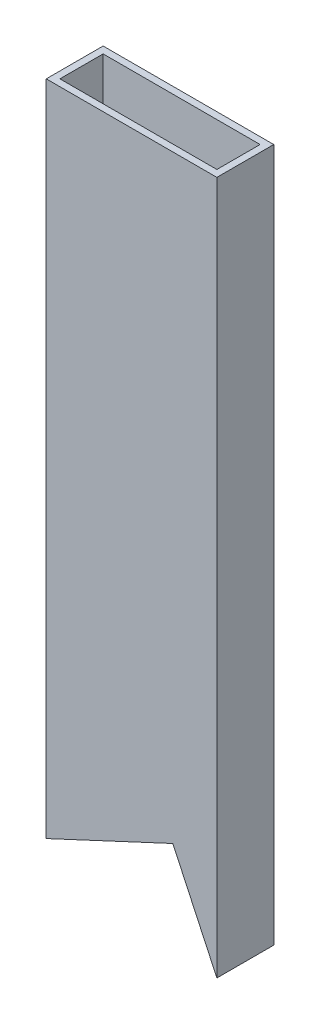
ISO-10303-21;
HEADER;
FILE_DESCRIPTION(('STEP AP214'),'2;1');
FILE_NAME('part.step','',(''),(''),'','','');
FILE_SCHEMA(('AUTOMOTIVE_DESIGN { 1 0 10303 214 1 1 1 1 }'));
ENDSEC;
DATA;
#1=APPLICATION_CONTEXT('core data for automotive mechanical design processes');
#2=APPLICATION_PROTOCOL_DEFINITION('international standard','automotive_design',2000,#1);
#3=PRODUCT_CONTEXT('',#1,'mechanical');
#4=PRODUCT('Part','Part','',(#3));
#5=PRODUCT_RELATED_PRODUCT_CATEGORY('part','',(#4));
#6=PRODUCT_DEFINITION_FORMATION('','',#4);
#7=PRODUCT_DEFINITION_CONTEXT('part definition',#1,'design');
#8=PRODUCT_DEFINITION('design','',#6,#7);
#9=PRODUCT_DEFINITION_SHAPE('','',#8);
#10=(LENGTH_UNIT() NAMED_UNIT(*) SI_UNIT(.MILLI.,.METRE.));
#11=(NAMED_UNIT(*) PLANE_ANGLE_UNIT() SI_UNIT($,.RADIAN.));
#12=(NAMED_UNIT(*) SI_UNIT($,.STERADIAN.) SOLID_ANGLE_UNIT());
#13=UNCERTAINTY_MEASURE_WITH_UNIT(LENGTH_MEASURE(1.E-05),#10,'distance_accuracy_value','');
#14=(GEOMETRIC_REPRESENTATION_CONTEXT(3) GLOBAL_UNCERTAINTY_ASSIGNED_CONTEXT((#13)) GLOBAL_UNIT_ASSIGNED_CONTEXT((#10,
#11,#12)) REPRESENTATION_CONTEXT('',''));
#15=CARTESIAN_POINT('',(0.,0.,0.));
#16=DIRECTION('',(0.,0.,1.));
#17=DIRECTION('',(1.,0.,0.));
#18=AXIS2_PLACEMENT_3D('',#15,#16,#17);
#19=CARTESIAN_POINT('',(-38.1,280.,-12.7));
#20=DIRECTION('',(1.,0.,0.));
#21=DIRECTION('',(0.,0.,-1.));
#22=AXIS2_PLACEMENT_3D('',#19,#20,#21);
#23=PLANE('',#22);
#24=DIRECTION('',(0.,0.,-1.));
#25=VECTOR('',#24,1.);
#26=CARTESIAN_POINT('',(-38.1,24.2723769367656,-12.7));
#27=LINE('',#26,#25);
#28=CARTESIAN_POINT('',(-38.1,24.2723769367657,12.7));
#29=VERTEX_POINT('',#28);
#30=CARTESIAN_POINT('',(-38.1,24.2723769367657,-12.7));
#31=VERTEX_POINT('',#30);
#32=EDGE_CURVE('E147',#29,#31,#27,.T.);
#33=ORIENTED_EDGE('',*,*,#32,.F.);
#34=DIRECTION('',(0.,-1.,0.));
#35=VECTOR('',#34,1.);
#36=CARTESIAN_POINT('',(-38.1,280.,12.7));
#37=LINE('',#36,#35);
#38=CARTESIAN_POINT('',(-38.1,318.1,12.7));
#39=VERTEX_POINT('',#38);
#40=EDGE_CURVE('E132',#39,#29,#37,.T.);
#41=ORIENTED_EDGE('',*,*,#40,.F.);
#42=DIRECTION('',(0.,0.,1.));
#43=VECTOR('',#42,1.);
#44=CARTESIAN_POINT('',(-38.1,318.1,-12.7));
#45=LINE('',#44,#43);
#46=CARTESIAN_POINT('',(-38.1,318.1,-12.7));
#47=VERTEX_POINT('',#46);
#48=EDGE_CURVE('E164',#47,#39,#45,.T.);
#49=ORIENTED_EDGE('',*,*,#48,.F.);
#50=DIRECTION('',(0.,-1.,0.));
#51=VECTOR('',#50,1.);
#52=CARTESIAN_POINT('',(-38.1,280.,-12.7));
#53=LINE('',#52,#51);
#54=EDGE_CURVE('E185',#47,#31,#53,.T.);
#55=ORIENTED_EDGE('',*,*,#54,.T.);
#56=EDGE_LOOP('',(#33,#41,#49,#55));
#57=FACE_BOUND('',#56,.T.);
#58=ADVANCED_FACE('F36',(#57),#23,.F.);
#59=CARTESIAN_POINT('',(-38.1,280.,12.7));
#60=DIRECTION('',(0.,0.,-1.));
#61=DIRECTION('',(-1.,0.,0.));
#62=AXIS2_PLACEMENT_3D('',#59,#60,#61);
#63=PLANE('',#62);
#64=DIRECTION('',(-0.906307787036651,-0.422618261740697,0.));
#65=VECTOR('',#64,1.);
#66=CARTESIAN_POINT('',(18.4285709137758,50.6320824584171,12.7));
#67=LINE('',#66,#65);
#68=CARTESIAN_POINT('',(18.4285709137758,50.6320824584171,12.7));
#69=VERTEX_POINT('',#68);
#70=EDGE_CURVE('E114',#69,#29,#67,.T.);
#71=ORIENTED_EDGE('',*,*,#70,.F.);
#72=DIRECTION('',(0.422618261740697,-0.906307787036651,0.));
#73=VECTOR('',#72,1.);
#74=CARTESIAN_POINT('',(50.6320824584169,-18.4285709137758,12.7));
#75=LINE('',#74,#73);
#76=CARTESIAN_POINT('',(38.1,8.44656664669596,12.7));
#77=VERTEX_POINT('',#76);
#78=EDGE_CURVE('E121',#69,#77,#75,.T.);
#79=ORIENTED_EDGE('',*,*,#78,.T.);
#80=DIRECTION('',(0.,-1.,0.));
#81=VECTOR('',#80,1.);
#82=CARTESIAN_POINT('',(38.1,280.,12.7));
#83=LINE('',#82,#81);
#84=CARTESIAN_POINT('',(38.1,318.1,12.7));
#85=VERTEX_POINT('',#84);
#86=EDGE_CURVE('E191',#85,#77,#83,.T.);
#87=ORIENTED_EDGE('',*,*,#86,.F.);
#88=DIRECTION('',(1.,0.,0.));
#89=VECTOR('',#88,1.);
#90=CARTESIAN_POINT('',(-38.1,318.1,12.7));
#91=LINE('',#90,#89);
#92=EDGE_CURVE('E167',#39,#85,#91,.T.);
#93=ORIENTED_EDGE('',*,*,#92,.F.);
#94=ORIENTED_EDGE('',*,*,#40,.T.);
#95=EDGE_LOOP('',(#71,#79,#87,#93,#94));
#96=FACE_BOUND('',#95,.T.);
#97=ADVANCED_FACE('F130',(#96),#63,.F.);
#98=CARTESIAN_POINT('',(38.1,280.,-12.7));
#99=DIRECTION('',(-1.,0.,0.));
#100=DIRECTION('',(0.,0.,1.));
#101=AXIS2_PLACEMENT_3D('',#98,#99,#100);
#102=PLANE('',#101);
#103=DIRECTION('',(0.,0.,1.));
#104=VECTOR('',#103,1.);
#105=CARTESIAN_POINT('',(38.1,8.44656664669596,-12.6999999999998));
#106=LINE('',#105,#104);
#107=CARTESIAN_POINT('',(38.1,8.44656664669602,-12.7));
#108=VERTEX_POINT('',#107);
#109=EDGE_CURVE('E124',#108,#77,#106,.T.);
#110=ORIENTED_EDGE('',*,*,#109,.F.);
#111=DIRECTION('',(0.,-1.,0.));
#112=VECTOR('',#111,1.);
#113=CARTESIAN_POINT('',(38.1,280.,-12.7));
#114=LINE('',#113,#112);
#115=CARTESIAN_POINT('',(38.1,318.1,-12.7));
#116=VERTEX_POINT('',#115);
#117=EDGE_CURVE('E188',#116,#108,#114,.T.);
#118=ORIENTED_EDGE('',*,*,#117,.F.);
#119=DIRECTION('',(0.,0.,-1.));
#120=VECTOR('',#119,1.);
#121=CARTESIAN_POINT('',(38.1,318.1,12.7));
#122=LINE('',#121,#120);
#123=EDGE_CURVE('E170',#85,#116,#122,.T.);
#124=ORIENTED_EDGE('',*,*,#123,.F.);
#125=ORIENTED_EDGE('',*,*,#86,.T.);
#126=EDGE_LOOP('',(#110,#118,#124,#125));
#127=FACE_BOUND('',#126,.T.);
#128=ADVANCED_FACE('F221',(#127),#102,.F.);
#129=CARTESIAN_POINT('',(-38.1,280.,-12.7));
#130=DIRECTION('',(0.,0.,1.));
#131=DIRECTION('',(1.,0.,0.));
#132=AXIS2_PLACEMENT_3D('',#129,#130,#131);
#133=PLANE('',#132);
#134=DIRECTION('',(-0.906307787036651,-0.422618261740697,0.));
#135=VECTOR('',#134,1.);
#136=CARTESIAN_POINT('',(18.4285709137758,50.6320824584171,-12.7));
#137=LINE('',#136,#135);
#138=CARTESIAN_POINT('',(18.4285709137758,50.6320824584171,-12.7));
#139=VERTEX_POINT('',#138);
#140=EDGE_CURVE('E133',#139,#31,#137,.T.);
#141=ORIENTED_EDGE('',*,*,#140,.T.);
#142=ORIENTED_EDGE('',*,*,#54,.F.);
#143=DIRECTION('',(-1.,0.,0.));
#144=VECTOR('',#143,1.);
#145=CARTESIAN_POINT('',(38.1,318.1,-12.7));
#146=LINE('',#145,#144);
#147=EDGE_CURVE('E161',#116,#47,#146,.T.);
#148=ORIENTED_EDGE('',*,*,#147,.F.);
#149=ORIENTED_EDGE('',*,*,#117,.T.);
#150=DIRECTION('',(-0.422618261740697,0.906307787036651,0.));
#151=VECTOR('',#150,1.);
#152=CARTESIAN_POINT('',(18.4285709137758,50.6320824584171,-12.7));
#153=LINE('',#152,#151);
#154=EDGE_CURVE('E127',#108,#139,#153,.T.);
#155=ORIENTED_EDGE('',*,*,#154,.T.);
#156=EDGE_LOOP('',(#141,#142,#148,#149,#155));
#157=FACE_BOUND('',#156,.T.);
#158=ADVANCED_FACE('F214',(#157),#133,.F.);
#159=CARTESIAN_POINT('',(-35.052,280.,-9.65199999999999));
#160=DIRECTION('',(1.,0.,0.));
#161=DIRECTION('',(0.,0.,-1.));
#162=AXIS2_PLACEMENT_3D('',#159,#160,#161);
#163=PLANE('',#162);
#164=DIRECTION('',(0.,-1.,0.));
#165=VECTOR('',#164,1.);
#166=CARTESIAN_POINT('',(-35.052,280.,9.652));
#167=LINE('',#166,#165);
#168=CARTESIAN_POINT('',(-35.052,318.1,9.652));
#169=VERTEX_POINT('',#168);
#170=CARTESIAN_POINT('',(-35.052,25.6936826788221,9.652));
#171=VERTEX_POINT('',#170);
#172=EDGE_CURVE('E182',#169,#171,#167,.T.);
#173=ORIENTED_EDGE('',*,*,#172,.T.);
#174=DIRECTION('',(0.,0.,-1.));
#175=VECTOR('',#174,1.);
#176=CARTESIAN_POINT('',(-35.052,25.6936826788221,-9.65199999999999));
#177=LINE('',#176,#175);
#178=CARTESIAN_POINT('',(-35.052,25.6936826788221,-9.65199999999999));
#179=VERTEX_POINT('',#178);
#180=EDGE_CURVE('E143',#171,#179,#177,.T.);
#181=ORIENTED_EDGE('',*,*,#180,.T.);
#182=DIRECTION('',(0.,-1.,0.));
#183=VECTOR('',#182,1.);
#184=CARTESIAN_POINT('',(-35.052,280.,-9.65199999999999));
#185=LINE('',#184,#183);
#186=CARTESIAN_POINT('',(-35.052,318.1,-9.65199999999999));
#187=VERTEX_POINT('',#186);
#188=EDGE_CURVE('E173',#187,#179,#185,.T.);
#189=ORIENTED_EDGE('',*,*,#188,.F.);
#190=DIRECTION('',(0.,0.,1.));
#191=VECTOR('',#190,1.);
#192=CARTESIAN_POINT('',(-35.052,318.1,-9.65199999999999));
#193=LINE('',#192,#191);
#194=EDGE_CURVE('E158',#187,#169,#193,.T.);
#195=ORIENTED_EDGE('',*,*,#194,.T.);
#196=EDGE_LOOP('',(#173,#181,#189,#195));
#197=FACE_BOUND('',#196,.T.);
#198=ADVANCED_FACE('F204',(#197),#163,.T.);
#199=CARTESIAN_POINT('',(-35.052,280.,9.652));
#200=DIRECTION('',(0.,0.,-1.));
#201=DIRECTION('',(-1.,0.,0.));
#202=AXIS2_PLACEMENT_3D('',#199,#200,#201);
#203=PLANE('',#202);
#204=DIRECTION('',(-0.422618261740697,0.906307787036651,0.));
#205=VECTOR('',#204,1.);
#206=CARTESIAN_POINT('',(-78.9763997031937,259.51771603854,9.652));
#207=LINE('',#206,#205);
#208=CARTESIAN_POINT('',(35.052,14.9830237404092,9.65199999999999));
#209=VERTEX_POINT('',#208);
#210=CARTESIAN_POINT('',(18.4285709137758,50.6320824584171,9.65199999999999));
#211=VERTEX_POINT('',#210);
#212=EDGE_CURVE('E135',#209,#211,#207,.T.);
#213=ORIENTED_EDGE('',*,*,#212,.T.);
#214=DIRECTION('',(-0.906307787036651,-0.422618261740697,0.));
#215=VECTOR('',#214,1.);
#216=CARTESIAN_POINT('',(62.3529706169695,71.1143664198773,9.65199999999999));
#217=LINE('',#216,#215);
#218=EDGE_CURVE('E117',#211,#171,#217,.T.);
#219=ORIENTED_EDGE('',*,*,#218,.T.);
#220=ORIENTED_EDGE('',*,*,#172,.F.);
#221=DIRECTION('',(1.,0.,0.));
#222=VECTOR('',#221,1.);
#223=CARTESIAN_POINT('',(-35.052,318.1,9.652));
#224=LINE('',#223,#222);
#225=CARTESIAN_POINT('',(35.052,318.1,9.65199999999999));
#226=VERTEX_POINT('',#225);
#227=EDGE_CURVE('E149',#169,#226,#224,.T.);
#228=ORIENTED_EDGE('',*,*,#227,.T.);
#229=DIRECTION('',(0.,-1.,0.));
#230=VECTOR('',#229,1.);
#231=CARTESIAN_POINT('',(35.052,280.,9.65199999999999));
#232=LINE('',#231,#230);
#233=EDGE_CURVE('E179',#226,#209,#232,.T.);
#234=ORIENTED_EDGE('',*,*,#233,.T.);
#235=EDGE_LOOP('',(#213,#219,#220,#228,#234));
#236=FACE_BOUND('',#235,.T.);
#237=ADVANCED_FACE('F206',(#236),#203,.T.);
#238=CARTESIAN_POINT('',(35.052,280.,-9.652));
#239=DIRECTION('',(-1.,0.,0.));
#240=DIRECTION('',(0.,0.,1.));
#241=AXIS2_PLACEMENT_3D('',#238,#239,#240);
#242=PLANE('',#241);
#243=DIRECTION('',(0.,-1.,0.));
#244=VECTOR('',#243,1.);
#245=CARTESIAN_POINT('',(35.052,280.,-9.652));
#246=LINE('',#245,#244);
#247=CARTESIAN_POINT('',(35.052,318.1,-9.652));
#248=VERTEX_POINT('',#247);
#249=CARTESIAN_POINT('',(35.052,14.9830237404092,-9.652));
#250=VERTEX_POINT('',#249);
#251=EDGE_CURVE('E176',#248,#250,#246,.T.);
#252=ORIENTED_EDGE('',*,*,#251,.T.);
#253=DIRECTION('',(0.,0.,1.));
#254=VECTOR('',#253,1.);
#255=CARTESIAN_POINT('',(35.052,14.9830237404092,-9.652));
#256=LINE('',#255,#254);
#257=EDGE_CURVE('E56',#250,#209,#256,.T.);
#258=ORIENTED_EDGE('',*,*,#257,.T.);
#259=ORIENTED_EDGE('',*,*,#233,.F.);
#260=DIRECTION('',(0.,0.,-1.));
#261=VECTOR('',#260,1.);
#262=CARTESIAN_POINT('',(35.052,318.1,9.65199999999999));
#263=LINE('',#262,#261);
#264=EDGE_CURVE('E152',#226,#248,#263,.T.);
#265=ORIENTED_EDGE('',*,*,#264,.T.);
#266=EDGE_LOOP('',(#252,#258,#259,#265));
#267=FACE_BOUND('',#266,.T.);
#268=ADVANCED_FACE('F196',(#267),#242,.T.);
#269=CARTESIAN_POINT('',(-35.052,280.,-9.65199999999999));
#270=DIRECTION('',(0.,0.,1.));
#271=DIRECTION('',(1.,0.,0.));
#272=AXIS2_PLACEMENT_3D('',#269,#270,#271);
#273=PLANE('',#272);
#274=ORIENTED_EDGE('',*,*,#188,.T.);
#275=DIRECTION('',(0.906307787036651,0.422618261740697,0.));
#276=VECTOR('',#275,1.);
#277=CARTESIAN_POINT('',(62.3529706169695,71.1143664198773,-9.652));
#278=LINE('',#277,#276);
#279=CARTESIAN_POINT('',(18.4285709137758,50.6320824584171,-9.65199999999999));
#280=VERTEX_POINT('',#279);
#281=EDGE_CURVE('E11',#179,#280,#278,.T.);
#282=ORIENTED_EDGE('',*,*,#281,.T.);
#283=DIRECTION('',(0.422618261740697,-0.906307787036651,0.));
#284=VECTOR('',#283,1.);
#285=CARTESIAN_POINT('',(-78.9763997031937,259.51771603854,-9.65199999999998));
#286=LINE('',#285,#284);
#287=EDGE_CURVE('E43',#280,#250,#286,.T.);
#288=ORIENTED_EDGE('',*,*,#287,.T.);
#289=ORIENTED_EDGE('',*,*,#251,.F.);
#290=DIRECTION('',(-1.,0.,0.));
#291=VECTOR('',#290,1.);
#292=CARTESIAN_POINT('',(35.052,318.1,-9.652));
#293=LINE('',#292,#291);
#294=EDGE_CURVE('E155',#248,#187,#293,.T.);
#295=ORIENTED_EDGE('',*,*,#294,.T.);
#296=EDGE_LOOP('',(#274,#282,#288,#289,#295));
#297=FACE_BOUND('',#296,.T.);
#298=ADVANCED_FACE('F194',(#297),#273,.T.);
#299=CARTESIAN_POINT('',(0.,318.1,0.));
#300=DIRECTION('',(0.,1.,0.));
#301=DIRECTION('',(0.,0.,1.));
#302=AXIS2_PLACEMENT_3D('',#299,#300,#301);
#303=PLANE('',#302);
#304=ORIENTED_EDGE('',*,*,#147,.T.);
#305=ORIENTED_EDGE('',*,*,#48,.T.);
#306=ORIENTED_EDGE('',*,*,#92,.T.);
#307=ORIENTED_EDGE('',*,*,#123,.T.);
#308=EDGE_LOOP('',(#304,#305,#306,#307));
#309=FACE_BOUND('',#308,.T.);
#310=ORIENTED_EDGE('',*,*,#264,.F.);
#311=ORIENTED_EDGE('',*,*,#227,.F.);
#312=ORIENTED_EDGE('',*,*,#194,.F.);
#313=ORIENTED_EDGE('',*,*,#294,.F.);
#314=EDGE_LOOP('',(#310,#311,#312,#313));
#315=FACE_BOUND('',#314,.T.);
#316=ADVANCED_FACE('F202',(#309,#315),#303,.T.);
#317=CARTESIAN_POINT('',(18.4285709137758,50.6320824584171,12.7));
#318=DIRECTION('',(0.422618261740697,-0.906307787036651,0.));
#319=DIRECTION('',(0.906307787036651,0.422618261740697,0.));
#320=AXIS2_PLACEMENT_3D('',#317,#318,#319);
#321=PLANE('',#320);
#322=ORIENTED_EDGE('',*,*,#32,.T.);
#323=ORIENTED_EDGE('',*,*,#140,.F.);
#324=DIRECTION('',(0.,0.,1.));
#325=VECTOR('',#324,1.);
#326=CARTESIAN_POINT('',(18.4285709137758,50.6320824584171,12.7));
#327=LINE('',#326,#325);
#328=EDGE_CURVE('E50',#139,#280,#327,.T.);
#329=ORIENTED_EDGE('',*,*,#328,.T.);
#330=ORIENTED_EDGE('',*,*,#281,.F.);
#331=ORIENTED_EDGE('',*,*,#180,.F.);
#332=ORIENTED_EDGE('',*,*,#218,.F.);
#333=EDGE_CURVE('E110',#211,#69,#327,.T.);
#334=ORIENTED_EDGE('',*,*,#333,.T.);
#335=ORIENTED_EDGE('',*,*,#70,.T.);
#336=EDGE_LOOP('',(#322,#323,#329,#330,#331,#332,#334,#335));
#337=FACE_BOUND('',#336,.T.);
#338=ADVANCED_FACE('F112',(#337),#321,.T.);
#339=CARTESIAN_POINT('',(34.5303266860964,16.1017557723206,0.));
#340=DIRECTION('',(-0.906307787036651,-0.422618261740697,0.));
#341=DIRECTION('',(0.422618261740697,-0.906307787036651,0.));
#342=AXIS2_PLACEMENT_3D('',#339,#340,#341);
#343=PLANE('',#342);
#344=ORIENTED_EDGE('',*,*,#109,.T.);
#345=ORIENTED_EDGE('',*,*,#78,.F.);
#346=ORIENTED_EDGE('',*,*,#333,.F.);
#347=ORIENTED_EDGE('',*,*,#212,.F.);
#348=ORIENTED_EDGE('',*,*,#257,.F.);
#349=ORIENTED_EDGE('',*,*,#287,.F.);
#350=ORIENTED_EDGE('',*,*,#328,.F.);
#351=ORIENTED_EDGE('',*,*,#154,.F.);
#352=EDGE_LOOP('',(#344,#345,#346,#347,#348,#349,#350,#351));
#353=FACE_BOUND('',#352,.T.);
#354=ADVANCED_FACE('F122',(#353),#343,.T.);
#355=CLOSED_SHELL('',(#58,#97,#128,#158,#198,#237,#268,#298,#316,#338,#354));
#356=MANIFOLD_SOLID_BREP('B2',#355);
#357=ADVANCED_BREP_SHAPE_REPRESENTATION('',(#18,#356),#14);
#358=SHAPE_DEFINITION_REPRESENTATION(#9,#357);
ENDSEC;
END-ISO-10303-21;
